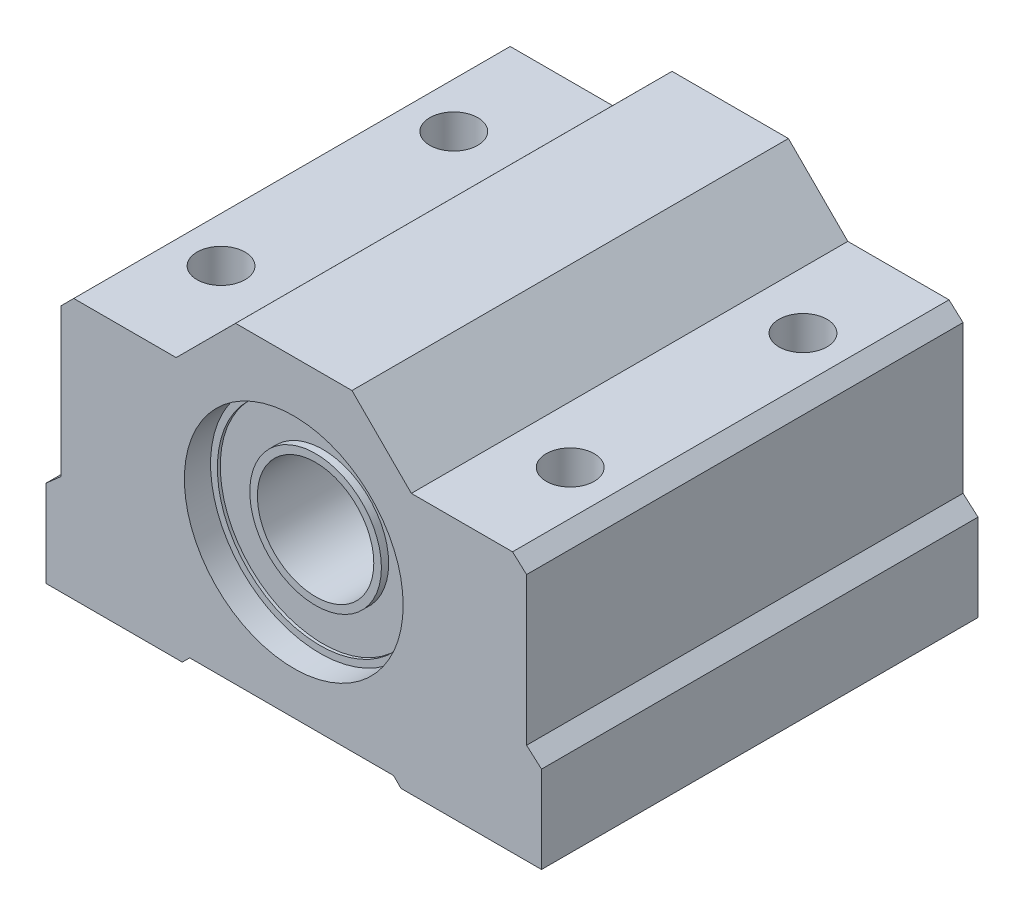
ISO-10303-21;
HEADER;
FILE_DESCRIPTION(('STEP AP214'),'2;1');
FILE_NAME('part.step','',(''),(''),'','','');
FILE_SCHEMA(('AUTOMOTIVE_DESIGN { 1 0 10303 214 1 1 1 1 }'));
ENDSEC;
DATA;
#1=APPLICATION_CONTEXT('core data for automotive mechanical design processes');
#2=APPLICATION_PROTOCOL_DEFINITION('international standard','automotive_design',2000,#1);
#3=PRODUCT_CONTEXT('',#1,'mechanical');
#4=PRODUCT('Part','Part','',(#3));
#5=PRODUCT_RELATED_PRODUCT_CATEGORY('part','',(#4));
#6=PRODUCT_DEFINITION_FORMATION('','',#4);
#7=PRODUCT_DEFINITION_CONTEXT('part definition',#1,'design');
#8=PRODUCT_DEFINITION('design','',#6,#7);
#9=PRODUCT_DEFINITION_SHAPE('','',#8);
#10=(LENGTH_UNIT() NAMED_UNIT(*) SI_UNIT(.MILLI.,.METRE.));
#11=(NAMED_UNIT(*) PLANE_ANGLE_UNIT() SI_UNIT($,.RADIAN.));
#12=(NAMED_UNIT(*) SI_UNIT($,.STERADIAN.) SOLID_ANGLE_UNIT());
#13=UNCERTAINTY_MEASURE_WITH_UNIT(LENGTH_MEASURE(1.E-05),#10,'distance_accuracy_value','');
#14=(GEOMETRIC_REPRESENTATION_CONTEXT(3) GLOBAL_UNCERTAINTY_ASSIGNED_CONTEXT((#13)) GLOBAL_UNIT_ASSIGNED_CONTEXT((#10,
#11,#12)) REPRESENTATION_CONTEXT('',''));
#15=CARTESIAN_POINT('',(0.,0.,0.));
#16=DIRECTION('',(0.,0.,1.));
#17=DIRECTION('',(1.,0.,0.));
#18=AXIS2_PLACEMENT_3D('',#15,#16,#17);
#19=CARTESIAN_POINT('',(0.,0.,-30.));
#20=DIRECTION('',(0.,0.,1.));
#21=DIRECTION('',(1.,0.,0.));
#22=AXIS2_PLACEMENT_3D('',#19,#20,#21);
#23=PLANE('',#22);
#24=DIRECTION('',(-0.748408560935745,-0.663237985882961,0.));
#25=VECTOR('',#24,1.);
#26=CARTESIAN_POINT('',(-5.00715940899254,5.65016034579369,-30.));
#27=LINE('',#26,#25);
#28=CARTESIAN_POINT('',(-15.9972160814821,-4.08920319527542,-30.));
#29=VERTEX_POINT('',#28);
#30=CARTESIAN_POINT('',(-17.03,-5.00445398438139,-30.));
#31=VERTEX_POINT('',#30);
#32=EDGE_CURVE('E254',#29,#31,#27,.T.);
#33=ORIENTED_EDGE('',*,*,#32,.F.);
#34=DIRECTION('',(0.,-1.,0.));
#35=VECTOR('',#34,1.);
#36=CARTESIAN_POINT('',(-15.9972160814821,0.,-30.));
#37=LINE('',#36,#35);
#38=CARTESIAN_POINT('',(-15.9972160814821,6.07141612040069,-30.));
#39=VERTEX_POINT('',#38);
#40=EDGE_CURVE('E192',#39,#29,#37,.T.);
#41=ORIENTED_EDGE('',*,*,#40,.F.);
#42=DIRECTION('',(-0.707106781186547,-0.707106781186548,0.));
#43=VECTOR('',#42,1.);
#44=CARTESIAN_POINT('',(-11.0343161009414,11.0343161009414,-30.));
#45=LINE('',#44,#43);
#46=CARTESIAN_POINT('',(-15.1243670871386,6.94426511474419,-30.));
#47=VERTEX_POINT('',#46);
#48=EDGE_CURVE('E177',#47,#39,#45,.T.);
#49=ORIENTED_EDGE('',*,*,#48,.F.);
#50=DIRECTION('',(-1.,0.,0.));
#51=VECTOR('',#50,1.);
#52=CARTESIAN_POINT('',(0.,6.9442651147442,-30.));
#53=LINE('',#52,#51);
#54=CARTESIAN_POINT('',(-8.083891516657,6.94426511474419,-30.));
#55=VERTEX_POINT('',#54);
#56=EDGE_CURVE('E190',#55,#47,#53,.T.);
#57=ORIENTED_EDGE('',*,*,#56,.F.);
#58=DIRECTION('',(-0.707276659522601,-0.706936862028393,0.));
#59=VECTOR('',#58,1.);
#60=CARTESIAN_POINT('',(-7.51213557308124,7.51574636915227,-30.));
#61=LINE('',#60,#59);
#62=CARTESIAN_POINT('',(-4.,11.0261946041163,-30.));
#63=VERTEX_POINT('',#62);
#64=EDGE_CURVE('E195',#63,#55,#61,.T.);
#65=ORIENTED_EDGE('',*,*,#64,.F.);
#66=DIRECTION('',(-1.,0.,0.));
#67=VECTOR('',#66,1.);
#68=CARTESIAN_POINT('',(0.,11.0261946041163,-30.));
#69=LINE('',#68,#67);
#70=CARTESIAN_POINT('',(4.,11.0261946041163,-30.));
#71=VERTEX_POINT('',#70);
#72=EDGE_CURVE('E197',#71,#63,#69,.T.);
#73=ORIENTED_EDGE('',*,*,#72,.F.);
#74=DIRECTION('',(-0.707106781186548,0.707106781186547,0.));
#75=VECTOR('',#74,1.);
#76=CARTESIAN_POINT('',(7.51309730205813,7.51309730205814,-30.));
#77=LINE('',#76,#75);
#78=CARTESIAN_POINT('',(8.0819294893721,6.94426511474417,-30.));
#79=VERTEX_POINT('',#78);
#80=EDGE_CURVE('E386',#79,#71,#77,.T.);
#81=ORIENTED_EDGE('',*,*,#80,.F.);
#82=DIRECTION('',(-1.,0.,0.));
#83=VECTOR('',#82,1.);
#84=CARTESIAN_POINT('',(0.,6.94426511474417,-30.));
#85=LINE('',#84,#83);
#86=CARTESIAN_POINT('',(15.0374546179448,6.94426511474418,-30.));
#87=VERTEX_POINT('',#86);
#88=EDGE_CURVE('E383',#87,#79,#85,.T.);
#89=ORIENTED_EDGE('',*,*,#88,.F.);
#90=DIRECTION('',(-0.741743771294362,0.670683366236272,0.));
#91=VECTOR('',#90,1.);
#92=CARTESIAN_POINT('',(10.2186901014741,11.301383208728,-30.));
#93=LINE('',#92,#91);
#94=CARTESIAN_POINT('',(16.0027839185179,6.07141612040066,-30.));
#95=VERTEX_POINT('',#94);
#96=EDGE_CURVE('E380',#95,#87,#93,.T.);
#97=ORIENTED_EDGE('',*,*,#96,.F.);
#98=DIRECTION('',(0.,1.,0.));
#99=VECTOR('',#98,1.);
#100=CARTESIAN_POINT('',(16.0027839185179,0.,-30.));
#101=LINE('',#100,#99);
#102=CARTESIAN_POINT('',(16.0027839185179,-4.08920319527547,-30.));
#103=VERTEX_POINT('',#102);
#104=EDGE_CURVE('E377',#103,#95,#101,.T.);
#105=ORIENTED_EDGE('',*,*,#104,.F.);
#106=DIRECTION('',(-0.749951735571776,0.661492550459097,0.));
#107=VECTOR('',#106,1.);
#108=CARTESIAN_POINT('',(4.97377394084638,5.63890008540626,-30.));
#109=LINE('',#108,#107);
#110=CARTESIAN_POINT('',(17.03,-4.99525588291164,-30.));
#111=VERTEX_POINT('',#110);
#112=EDGE_CURVE('E374',#111,#103,#109,.T.);
#113=ORIENTED_EDGE('',*,*,#112,.F.);
#114=DIRECTION('',(0.,1.,0.));
#115=VECTOR('',#114,1.);
#116=CARTESIAN_POINT('',(17.03,0.,-30.));
#117=LINE('',#116,#115);
#118=CARTESIAN_POINT('',(17.03,-10.9738053958837,-30.));
#119=VERTEX_POINT('',#118);
#120=EDGE_CURVE('E371',#119,#111,#117,.T.);
#121=ORIENTED_EDGE('',*,*,#120,.F.);
#122=DIRECTION('',(1.,0.,0.));
#123=VECTOR('',#122,1.);
#124=CARTESIAN_POINT('',(0.,-10.9738053958837,-30.));
#125=LINE('',#124,#123);
#126=CARTESIAN_POINT('',(7.36706184571891,-10.9738053958837,-30.));
#127=VERTEX_POINT('',#126);
#128=EDGE_CURVE('E368',#127,#119,#125,.T.);
#129=ORIENTED_EDGE('',*,*,#128,.F.);
#130=DIRECTION('',(0.707106781186548,-0.707106781186547,0.));
#131=VECTOR('',#130,1.);
#132=CARTESIAN_POINT('',(-1.80337177508242,-1.80337177508242,-30.));
#133=LINE('',#132,#131);
#134=CARTESIAN_POINT('',(6.85761623335725,-10.4643597835221,-30.));
#135=VERTEX_POINT('',#134);
#136=EDGE_CURVE('E365',#135,#127,#133,.T.);
#137=ORIENTED_EDGE('',*,*,#136,.F.);
#138=DIRECTION('',(1.,0.,0.));
#139=VECTOR('',#138,1.);
#140=CARTESIAN_POINT('',(0.,-10.4643597835221,-30.));
#141=LINE('',#140,#139);
#142=CARTESIAN_POINT('',(-7.15322917727557,-10.4643597835221,-30.));
#143=VERTEX_POINT('',#142);
#144=EDGE_CURVE('E362',#143,#135,#141,.T.);
#145=ORIENTED_EDGE('',*,*,#144,.F.);
#146=DIRECTION('',(0.707106781186549,0.707106781186546,0.));
#147=VECTOR('',#146,1.);
#148=CARTESIAN_POINT('',(1.65556530312327,-1.65556530312328,-30.));
#149=LINE('',#148,#147);
#150=CARTESIAN_POINT('',(-7.66267478963722,-10.9738053958837,-30.));
#151=VERTEX_POINT('',#150);
#152=EDGE_CURVE('E359',#151,#143,#149,.T.);
#153=ORIENTED_EDGE('',*,*,#152,.F.);
#154=DIRECTION('',(1.,0.,0.));
#155=VECTOR('',#154,1.);
#156=CARTESIAN_POINT('',(0.,-10.9738053958837,-30.));
#157=LINE('',#156,#155);
#158=CARTESIAN_POINT('',(-17.03,-10.9738053958837,-30.));
#159=VERTEX_POINT('',#158);
#160=EDGE_CURVE('E356',#159,#151,#157,.T.);
#161=ORIENTED_EDGE('',*,*,#160,.F.);
#162=DIRECTION('',(0.,-1.,0.));
#163=VECTOR('',#162,1.);
#164=CARTESIAN_POINT('',(-17.03,0.,-30.));
#165=LINE('',#164,#163);
#166=EDGE_CURVE('E354',#31,#159,#165,.T.);
#167=ORIENTED_EDGE('',*,*,#166,.F.);
#168=EDGE_LOOP('',(#33,#41,#49,#57,#65,#73,#81,#89,#97,#105,#113,#121,#129,#137,#145,#153,#161,#167));
#169=FACE_BOUND('',#168,.T.);
#170=CARTESIAN_POINT('',(0.,0.,-30.));
#171=DIRECTION('',(0.,0.,1.));
#172=DIRECTION('',(1.,0.,0.));
#173=AXIS2_PLACEMENT_3D('',#170,#171,#172);
#174=CIRCLE('',#173,7.51901731530374);
#175=CARTESIAN_POINT('',(7.51901731530374,0.,-30.));
#176=VERTEX_POINT('',#175);
#177=EDGE_CURVE('E329',#176,#176,#174,.T.);
#178=ORIENTED_EDGE('',*,*,#177,.T.);
#179=EDGE_LOOP('',(#178));
#180=FACE_BOUND('',#179,.T.);
#181=ADVANCED_FACE('F43',(#169,#180),#23,.F.);
#182=CARTESIAN_POINT('',(0.,0.,-2.));
#183=DIRECTION('',(0.,0.,1.));
#184=DIRECTION('',(1.,0.,0.));
#185=AXIS2_PLACEMENT_3D('',#182,#183,#184);
#186=CYLINDRICAL_SURFACE('',#185,7.0517883155918);
#187=CARTESIAN_POINT('',(0.,0.,-2.));
#188=DIRECTION('',(0.,0.,1.));
#189=DIRECTION('',(1.,0.,0.));
#190=AXIS2_PLACEMENT_3D('',#187,#188,#189);
#191=CIRCLE('',#190,7.0517883155918);
#192=CARTESIAN_POINT('',(7.0517883155918,0.,-2.));
#193=VERTEX_POINT('',#192);
#194=EDGE_CURVE('E336',#193,#193,#191,.T.);
#195=ORIENTED_EDGE('',*,*,#194,.F.);
#196=EDGE_LOOP('',(#195));
#197=FACE_BOUND('',#196,.T.);
#198=CARTESIAN_POINT('',(0.,0.,-1.8));
#199=DIRECTION('',(0.,0.,1.));
#200=DIRECTION('',(1.,0.,0.));
#201=AXIS2_PLACEMENT_3D('',#198,#199,#200);
#202=CIRCLE('',#201,7.0517883155918);
#203=CARTESIAN_POINT('',(7.0517883155918,0.,-1.8));
#204=VERTEX_POINT('',#203);
#205=EDGE_CURVE('E322',#204,#204,#202,.T.);
#206=ORIENTED_EDGE('',*,*,#205,.T.);
#207=EDGE_LOOP('',(#206));
#208=FACE_BOUND('',#207,.T.);
#209=ADVANCED_FACE('F298',(#197,#208),#186,.F.);
#210=CARTESIAN_POINT('',(0.,0.,-28.5));
#211=DIRECTION('',(0.,0.,1.));
#212=DIRECTION('',(1.,0.,0.));
#213=AXIS2_PLACEMENT_3D('',#210,#211,#212);
#214=CYLINDRICAL_SURFACE('',#213,4.);
#215=CARTESIAN_POINT('',(0.,0.,-28.5));
#216=DIRECTION('',(0.,0.,1.));
#217=DIRECTION('',(1.,0.,0.));
#218=AXIS2_PLACEMENT_3D('',#215,#216,#217);
#219=CIRCLE('',#218,4.);
#220=CARTESIAN_POINT('',(4.,0.,-28.5));
#221=VERTEX_POINT('',#220);
#222=EDGE_CURVE('E345',#221,#221,#219,.T.);
#223=ORIENTED_EDGE('',*,*,#222,.F.);
#224=EDGE_LOOP('',(#223));
#225=FACE_BOUND('',#224,.T.);
#226=CARTESIAN_POINT('',(0.,0.,-1.5));
#227=DIRECTION('',(0.,0.,1.));
#228=DIRECTION('',(1.,0.,0.));
#229=AXIS2_PLACEMENT_3D('',#226,#227,#228);
#230=CIRCLE('',#229,4.);
#231=CARTESIAN_POINT('',(4.,0.,-1.5));
#232=VERTEX_POINT('',#231);
#233=EDGE_CURVE('E342',#232,#232,#230,.T.);
#234=ORIENTED_EDGE('',*,*,#233,.T.);
#235=EDGE_LOOP('',(#234));
#236=FACE_BOUND('',#235,.T.);
#237=ADVANCED_FACE('F303',(#225,#236),#214,.F.);
#238=CARTESIAN_POINT('',(0.,0.,-30.));
#239=DIRECTION('',(0.,0.,1.));
#240=DIRECTION('',(1.,0.,0.));
#241=AXIS2_PLACEMENT_3D('',#238,#239,#240);
#242=CYLINDRICAL_SURFACE('',#241,7.0517883155918);
#243=CARTESIAN_POINT('',(0.,0.,-28.2));
#244=DIRECTION('',(0.,0.,1.));
#245=DIRECTION('',(1.,0.,0.));
#246=AXIS2_PLACEMENT_3D('',#243,#244,#245);
#247=CIRCLE('',#246,7.0517883155918);
#248=CARTESIAN_POINT('',(7.0517883155918,0.,-28.2));
#249=VERTEX_POINT('',#248);
#250=EDGE_CURVE('E486',#249,#249,#247,.T.);
#251=ORIENTED_EDGE('',*,*,#250,.F.);
#252=EDGE_LOOP('',(#251));
#253=FACE_BOUND('',#252,.T.);
#254=CARTESIAN_POINT('',(0.,0.,-28.));
#255=DIRECTION('',(0.,0.,1.));
#256=DIRECTION('',(1.,0.,0.));
#257=AXIS2_PLACEMENT_3D('',#254,#255,#256);
#258=CIRCLE('',#257,7.0517883155918);
#259=CARTESIAN_POINT('',(7.0517883155918,0.,-28.));
#260=VERTEX_POINT('',#259);
#261=EDGE_CURVE('E12',#260,#260,#258,.F.);
#262=ORIENTED_EDGE('',*,*,#261,.F.);
#263=EDGE_LOOP('',(#262));
#264=FACE_BOUND('',#263,.T.);
#265=ADVANCED_FACE('F295',(#253,#264),#242,.F.);
#266=CARTESIAN_POINT('',(-5.00715940899254,5.65016034579369,-30.));
#267=DIRECTION('',(-0.663237985882961,0.748408560935745,0.));
#268=DIRECTION('',(-0.748408560935745,-0.663237985882961,0.));
#269=AXIS2_PLACEMENT_3D('',#266,#267,#268);
#270=PLANE('',#269);
#271=DIRECTION('',(-0.748408560935745,-0.663237985882961,0.));
#272=VECTOR('',#271,1.);
#273=CARTESIAN_POINT('',(-5.00715940899254,5.65016034579369,0.));
#274=LINE('',#273,#272);
#275=CARTESIAN_POINT('',(-15.9972160814821,-4.08920319527542,0.));
#276=VERTEX_POINT('',#275);
#277=CARTESIAN_POINT('',(-17.03,-5.00445398438139,0.));
#278=VERTEX_POINT('',#277);
#279=EDGE_CURVE('E202',#276,#278,#274,.T.);
#280=ORIENTED_EDGE('',*,*,#279,.F.);
#281=DIRECTION('',(0.,0.,1.));
#282=VECTOR('',#281,1.);
#283=CARTESIAN_POINT('',(-15.9972160814821,-4.08920319527542,-30.));
#284=LINE('',#283,#282);
#285=EDGE_CURVE('E52',#29,#276,#284,.T.);
#286=ORIENTED_EDGE('',*,*,#285,.F.);
#287=ORIENTED_EDGE('',*,*,#32,.T.);
#288=DIRECTION('',(0.,0.,1.));
#289=VECTOR('',#288,1.);
#290=CARTESIAN_POINT('',(-17.03,-5.00445398438139,-30.));
#291=LINE('',#290,#289);
#292=EDGE_CURVE('E130',#31,#278,#291,.T.);
#293=ORIENTED_EDGE('',*,*,#292,.T.);
#294=EDGE_LOOP('',(#280,#286,#287,#293));
#295=FACE_BOUND('',#294,.T.);
#296=ADVANCED_FACE('F45',(#295),#270,.T.);
#297=CARTESIAN_POINT('',(-15.9972160814821,0.,-30.));
#298=DIRECTION('',(-1.,0.,0.));
#299=DIRECTION('',(0.,0.,1.));
#300=AXIS2_PLACEMENT_3D('',#297,#298,#299);
#301=PLANE('',#300);
#302=DIRECTION('',(0.,-1.,0.));
#303=VECTOR('',#302,1.);
#304=CARTESIAN_POINT('',(-15.9972160814821,0.,0.));
#305=LINE('',#304,#303);
#306=CARTESIAN_POINT('',(-15.9972160814821,6.07141612040069,0.));
#307=VERTEX_POINT('',#306);
#308=EDGE_CURVE('E251',#307,#276,#305,.T.);
#309=ORIENTED_EDGE('',*,*,#308,.F.);
#310=DIRECTION('',(0.,0.,1.));
#311=VECTOR('',#310,1.);
#312=CARTESIAN_POINT('',(-15.9972160814821,6.07141612040069,-30.));
#313=LINE('',#312,#311);
#314=EDGE_CURVE('E118',#39,#307,#313,.T.);
#315=ORIENTED_EDGE('',*,*,#314,.F.);
#316=ORIENTED_EDGE('',*,*,#40,.T.);
#317=ORIENTED_EDGE('',*,*,#285,.T.);
#318=EDGE_LOOP('',(#309,#315,#316,#317));
#319=FACE_BOUND('',#318,.T.);
#320=ADVANCED_FACE('F287',(#319),#301,.T.);
#321=CARTESIAN_POINT('',(-11.0343161009414,11.0343161009414,-30.));
#322=DIRECTION('',(-0.707106781186548,0.707106781186547,0.));
#323=DIRECTION('',(-0.707106781186547,-0.707106781186548,0.));
#324=AXIS2_PLACEMENT_3D('',#321,#322,#323);
#325=PLANE('',#324);
#326=DIRECTION('',(-0.707106781186547,-0.707106781186548,0.));
#327=VECTOR('',#326,1.);
#328=CARTESIAN_POINT('',(-11.0343161009414,11.0343161009414,0.));
#329=LINE('',#328,#327);
#330=CARTESIAN_POINT('',(-15.1243670871386,6.94426511474419,0.));
#331=VERTEX_POINT('',#330);
#332=EDGE_CURVE('E179',#331,#307,#329,.T.);
#333=ORIENTED_EDGE('',*,*,#332,.F.);
#334=DIRECTION('',(0.,0.,1.));
#335=VECTOR('',#334,1.);
#336=CARTESIAN_POINT('',(-15.1243670871386,6.94426511474419,-30.));
#337=LINE('',#336,#335);
#338=EDGE_CURVE('E174',#47,#331,#337,.T.);
#339=ORIENTED_EDGE('',*,*,#338,.F.);
#340=ORIENTED_EDGE('',*,*,#48,.T.);
#341=ORIENTED_EDGE('',*,*,#314,.T.);
#342=EDGE_LOOP('',(#333,#339,#340,#341));
#343=FACE_BOUND('',#342,.T.);
#344=ADVANCED_FACE('F176',(#343),#325,.T.);
#345=CARTESIAN_POINT('',(0.,6.9442651147442,-30.));
#346=DIRECTION('',(0.,1.,0.));
#347=DIRECTION('',(-1.,0.,0.));
#348=AXIS2_PLACEMENT_3D('',#345,#346,#347);
#349=PLANE('',#348);
#350=CARTESIAN_POINT('',(-12.,6.9442651147442,-23.));
#351=DIRECTION('',(0.,1.,0.));
#352=DIRECTION('',(-1.,0.,0.));
#353=AXIS2_PLACEMENT_3D('',#350,#351,#352);
#354=CIRCLE('',#353,1.65);
#355=CARTESIAN_POINT('',(-13.65,6.9442651147442,-23.));
#356=VERTEX_POINT('',#355);
#357=EDGE_CURVE('E483',#356,#356,#354,.T.);
#358=ORIENTED_EDGE('',*,*,#357,.F.);
#359=EDGE_LOOP('',(#358));
#360=FACE_BOUND('',#359,.T.);
#361=CARTESIAN_POINT('',(-12.,6.9442651147442,-7.));
#362=DIRECTION('',(0.,1.,0.));
#363=DIRECTION('',(-1.,0.,0.));
#364=AXIS2_PLACEMENT_3D('',#361,#362,#363);
#365=CIRCLE('',#364,1.65);
#366=CARTESIAN_POINT('',(-13.65,6.9442651147442,-7.));
#367=VERTEX_POINT('',#366);
#368=EDGE_CURVE('E482',#367,#367,#365,.T.);
#369=ORIENTED_EDGE('',*,*,#368,.F.);
#370=EDGE_LOOP('',(#369));
#371=FACE_BOUND('',#370,.T.);
#372=DIRECTION('',(-1.,0.,0.));
#373=VECTOR('',#372,1.);
#374=CARTESIAN_POINT('',(0.,6.9442651147442,0.));
#375=LINE('',#374,#373);
#376=CARTESIAN_POINT('',(-8.083891516657,6.94426511474419,0.));
#377=VERTEX_POINT('',#376);
#378=EDGE_CURVE('E248',#377,#331,#375,.T.);
#379=ORIENTED_EDGE('',*,*,#378,.F.);
#380=DIRECTION('',(0.,0.,1.));
#381=VECTOR('',#380,1.);
#382=CARTESIAN_POINT('',(-8.083891516657,6.94426511474419,-30.));
#383=LINE('',#382,#381);
#384=EDGE_CURVE('E184',#55,#377,#383,.T.);
#385=ORIENTED_EDGE('',*,*,#384,.F.);
#386=ORIENTED_EDGE('',*,*,#56,.T.);
#387=ORIENTED_EDGE('',*,*,#338,.T.);
#388=EDGE_LOOP('',(#379,#385,#386,#387));
#389=FACE_BOUND('',#388,.T.);
#390=ADVANCED_FACE('F194',(#360,#371,#389),#349,.T.);
#391=CARTESIAN_POINT('',(-7.51213557308124,7.51574636915227,-30.));
#392=DIRECTION('',(-0.706936862028393,0.707276659522601,0.));
#393=DIRECTION('',(-0.707276659522601,-0.706936862028393,0.));
#394=AXIS2_PLACEMENT_3D('',#391,#392,#393);
#395=PLANE('',#394);
#396=DIRECTION('',(-0.707276659522601,-0.706936862028393,0.));
#397=VECTOR('',#396,1.);
#398=CARTESIAN_POINT('',(-7.51213557308124,7.51574636915227,0.));
#399=LINE('',#398,#397);
#400=CARTESIAN_POINT('',(-4.,11.0261946041163,0.));
#401=VERTEX_POINT('',#400);
#402=EDGE_CURVE('E245',#401,#377,#399,.T.);
#403=ORIENTED_EDGE('',*,*,#402,.F.);
#404=DIRECTION('',(0.,0.,1.));
#405=VECTOR('',#404,1.);
#406=CARTESIAN_POINT('',(-4.,11.0261946041163,-30.));
#407=LINE('',#406,#405);
#408=EDGE_CURVE('E258',#63,#401,#407,.T.);
#409=ORIENTED_EDGE('',*,*,#408,.F.);
#410=ORIENTED_EDGE('',*,*,#64,.T.);
#411=ORIENTED_EDGE('',*,*,#384,.T.);
#412=EDGE_LOOP('',(#403,#409,#410,#411));
#413=FACE_BOUND('',#412,.T.);
#414=ADVANCED_FACE('F437',(#413),#395,.T.);
#415=CARTESIAN_POINT('',(0.,11.0261946041163,-30.));
#416=DIRECTION('',(0.,1.,0.));
#417=DIRECTION('',(-1.,0.,0.));
#418=AXIS2_PLACEMENT_3D('',#415,#416,#417);
#419=PLANE('',#418);
#420=DIRECTION('',(-1.,0.,0.));
#421=VECTOR('',#420,1.);
#422=CARTESIAN_POINT('',(0.,11.0261946041163,0.));
#423=LINE('',#422,#421);
#424=CARTESIAN_POINT('',(4.,11.0261946041163,0.));
#425=VERTEX_POINT('',#424);
#426=EDGE_CURVE('E242',#425,#401,#423,.T.);
#427=ORIENTED_EDGE('',*,*,#426,.F.);
#428=DIRECTION('',(0.,0.,1.));
#429=VECTOR('',#428,1.);
#430=CARTESIAN_POINT('',(4.,11.0261946041163,-30.));
#431=LINE('',#430,#429);
#432=EDGE_CURVE('E260',#71,#425,#431,.T.);
#433=ORIENTED_EDGE('',*,*,#432,.F.);
#434=ORIENTED_EDGE('',*,*,#72,.T.);
#435=ORIENTED_EDGE('',*,*,#408,.T.);
#436=EDGE_LOOP('',(#427,#433,#434,#435));
#437=FACE_BOUND('',#436,.T.);
#438=ADVANCED_FACE('F392',(#437),#419,.T.);
#439=CARTESIAN_POINT('',(7.51309730205813,7.51309730205814,-30.));
#440=DIRECTION('',(0.707106781186547,0.707106781186548,0.));
#441=DIRECTION('',(-0.707106781186548,0.707106781186547,0.));
#442=AXIS2_PLACEMENT_3D('',#439,#440,#441);
#443=PLANE('',#442);
#444=DIRECTION('',(-0.707106781186548,0.707106781186547,0.));
#445=VECTOR('',#444,1.);
#446=CARTESIAN_POINT('',(7.51309730205813,7.51309730205814,0.));
#447=LINE('',#446,#445);
#448=CARTESIAN_POINT('',(8.0819294893721,6.94426511474417,0.));
#449=VERTEX_POINT('',#448);
#450=EDGE_CURVE('E239',#449,#425,#447,.T.);
#451=ORIENTED_EDGE('',*,*,#450,.F.);
#452=DIRECTION('',(0.,0.,1.));
#453=VECTOR('',#452,1.);
#454=CARTESIAN_POINT('',(8.0819294893721,6.94426511474417,-30.));
#455=LINE('',#454,#453);
#456=EDGE_CURVE('E262',#79,#449,#455,.T.);
#457=ORIENTED_EDGE('',*,*,#456,.F.);
#458=ORIENTED_EDGE('',*,*,#80,.T.);
#459=ORIENTED_EDGE('',*,*,#432,.T.);
#460=EDGE_LOOP('',(#451,#457,#458,#459));
#461=FACE_BOUND('',#460,.T.);
#462=ADVANCED_FACE('F398',(#461),#443,.T.);
#463=CARTESIAN_POINT('',(0.,6.94426511474417,-30.));
#464=DIRECTION('',(0.,1.,0.));
#465=DIRECTION('',(-1.,0.,0.));
#466=AXIS2_PLACEMENT_3D('',#463,#464,#465);
#467=PLANE('',#466);
#468=CARTESIAN_POINT('',(12.,6.94426511474417,-7.));
#469=DIRECTION('',(0.,1.,0.));
#470=DIRECTION('',(-1.,0.,0.));
#471=AXIS2_PLACEMENT_3D('',#468,#469,#470);
#472=CIRCLE('',#471,1.65);
#473=CARTESIAN_POINT('',(10.35,6.94426511474417,-7.));
#474=VERTEX_POINT('',#473);
#475=EDGE_CURVE('E794',#474,#474,#472,.T.);
#476=ORIENTED_EDGE('',*,*,#475,.F.);
#477=EDGE_LOOP('',(#476));
#478=FACE_BOUND('',#477,.T.);
#479=CARTESIAN_POINT('',(12.,6.94426511474417,-23.));
#480=DIRECTION('',(0.,1.,0.));
#481=DIRECTION('',(-1.,0.,0.));
#482=AXIS2_PLACEMENT_3D('',#479,#480,#481);
#483=CIRCLE('',#482,1.65);
#484=CARTESIAN_POINT('',(10.35,6.94426511474417,-23.));
#485=VERTEX_POINT('',#484);
#486=EDGE_CURVE('E804',#485,#485,#483,.T.);
#487=ORIENTED_EDGE('',*,*,#486,.F.);
#488=EDGE_LOOP('',(#487));
#489=FACE_BOUND('',#488,.T.);
#490=DIRECTION('',(-1.,0.,0.));
#491=VECTOR('',#490,1.);
#492=CARTESIAN_POINT('',(0.,6.94426511474417,0.));
#493=LINE('',#492,#491);
#494=CARTESIAN_POINT('',(15.0374546179448,6.94426511474418,0.));
#495=VERTEX_POINT('',#494);
#496=EDGE_CURVE('E236',#495,#449,#493,.T.);
#497=ORIENTED_EDGE('',*,*,#496,.F.);
#498=DIRECTION('',(0.,0.,1.));
#499=VECTOR('',#498,1.);
#500=CARTESIAN_POINT('',(15.0374546179448,6.94426511474418,-30.));
#501=LINE('',#500,#499);
#502=EDGE_CURVE('E264',#87,#495,#501,.T.);
#503=ORIENTED_EDGE('',*,*,#502,.F.);
#504=ORIENTED_EDGE('',*,*,#88,.T.);
#505=ORIENTED_EDGE('',*,*,#456,.T.);
#506=EDGE_LOOP('',(#497,#503,#504,#505));
#507=FACE_BOUND('',#506,.T.);
#508=ADVANCED_FACE('F401',(#478,#489,#507),#467,.T.);
#509=CARTESIAN_POINT('',(10.2186901014741,11.301383208728,-30.));
#510=DIRECTION('',(0.670683366236272,0.741743771294362,0.));
#511=DIRECTION('',(-0.741743771294362,0.670683366236272,0.));
#512=AXIS2_PLACEMENT_3D('',#509,#510,#511);
#513=PLANE('',#512);
#514=DIRECTION('',(-0.741743771294362,0.670683366236272,0.));
#515=VECTOR('',#514,1.);
#516=CARTESIAN_POINT('',(10.2186901014741,11.301383208728,0.));
#517=LINE('',#516,#515);
#518=CARTESIAN_POINT('',(16.0027839185179,6.07141612040066,0.));
#519=VERTEX_POINT('',#518);
#520=EDGE_CURVE('E233',#519,#495,#517,.T.);
#521=ORIENTED_EDGE('',*,*,#520,.F.);
#522=DIRECTION('',(0.,0.,1.));
#523=VECTOR('',#522,1.);
#524=CARTESIAN_POINT('',(16.0027839185179,6.07141612040066,-30.));
#525=LINE('',#524,#523);
#526=EDGE_CURVE('E266',#95,#519,#525,.T.);
#527=ORIENTED_EDGE('',*,*,#526,.F.);
#528=ORIENTED_EDGE('',*,*,#96,.T.);
#529=ORIENTED_EDGE('',*,*,#502,.T.);
#530=EDGE_LOOP('',(#521,#527,#528,#529));
#531=FACE_BOUND('',#530,.T.);
#532=ADVANCED_FACE('F406',(#531),#513,.T.);
#533=CARTESIAN_POINT('',(16.0027839185179,0.,-30.));
#534=DIRECTION('',(1.,0.,0.));
#535=DIRECTION('',(0.,0.,-1.));
#536=AXIS2_PLACEMENT_3D('',#533,#534,#535);
#537=PLANE('',#536);
#538=DIRECTION('',(0.,1.,0.));
#539=VECTOR('',#538,1.);
#540=CARTESIAN_POINT('',(16.0027839185179,0.,0.));
#541=LINE('',#540,#539);
#542=CARTESIAN_POINT('',(16.0027839185179,-4.08920319527547,0.));
#543=VERTEX_POINT('',#542);
#544=EDGE_CURVE('E230',#543,#519,#541,.T.);
#545=ORIENTED_EDGE('',*,*,#544,.F.);
#546=DIRECTION('',(0.,0.,1.));
#547=VECTOR('',#546,1.);
#548=CARTESIAN_POINT('',(16.0027839185179,-4.08920319527547,-30.));
#549=LINE('',#548,#547);
#550=EDGE_CURVE('E268',#103,#543,#549,.T.);
#551=ORIENTED_EDGE('',*,*,#550,.F.);
#552=ORIENTED_EDGE('',*,*,#104,.T.);
#553=ORIENTED_EDGE('',*,*,#526,.T.);
#554=EDGE_LOOP('',(#545,#551,#552,#553));
#555=FACE_BOUND('',#554,.T.);
#556=ADVANCED_FACE('F409',(#555),#537,.T.);
#557=CARTESIAN_POINT('',(4.97377394084638,5.63890008540626,-30.));
#558=DIRECTION('',(0.661492550459097,0.749951735571776,0.));
#559=DIRECTION('',(-0.749951735571776,0.661492550459097,0.));
#560=AXIS2_PLACEMENT_3D('',#557,#558,#559);
#561=PLANE('',#560);
#562=DIRECTION('',(-0.749951735571776,0.661492550459097,0.));
#563=VECTOR('',#562,1.);
#564=CARTESIAN_POINT('',(4.97377394084638,5.63890008540626,0.));
#565=LINE('',#564,#563);
#566=CARTESIAN_POINT('',(17.03,-4.99525588291164,0.));
#567=VERTEX_POINT('',#566);
#568=EDGE_CURVE('E227',#567,#543,#565,.T.);
#569=ORIENTED_EDGE('',*,*,#568,.F.);
#570=DIRECTION('',(0.,0.,1.));
#571=VECTOR('',#570,1.);
#572=CARTESIAN_POINT('',(17.03,-4.99525588291164,-30.));
#573=LINE('',#572,#571);
#574=EDGE_CURVE('E270',#111,#567,#573,.T.);
#575=ORIENTED_EDGE('',*,*,#574,.F.);
#576=ORIENTED_EDGE('',*,*,#112,.T.);
#577=ORIENTED_EDGE('',*,*,#550,.T.);
#578=EDGE_LOOP('',(#569,#575,#576,#577));
#579=FACE_BOUND('',#578,.T.);
#580=ADVANCED_FACE('F414',(#579),#561,.T.);
#581=CARTESIAN_POINT('',(17.03,0.,-30.));
#582=DIRECTION('',(1.,0.,0.));
#583=DIRECTION('',(0.,0.,-1.));
#584=AXIS2_PLACEMENT_3D('',#581,#582,#583);
#585=PLANE('',#584);
#586=DIRECTION('',(0.,1.,0.));
#587=VECTOR('',#586,1.);
#588=CARTESIAN_POINT('',(17.03,0.,0.));
#589=LINE('',#588,#587);
#590=CARTESIAN_POINT('',(17.03,-10.9738053958837,0.));
#591=VERTEX_POINT('',#590);
#592=EDGE_CURVE('E224',#591,#567,#589,.T.);
#593=ORIENTED_EDGE('',*,*,#592,.F.);
#594=DIRECTION('',(0.,0.,1.));
#595=VECTOR('',#594,1.);
#596=CARTESIAN_POINT('',(17.03,-10.9738053958837,-30.));
#597=LINE('',#596,#595);
#598=EDGE_CURVE('E272',#119,#591,#597,.T.);
#599=ORIENTED_EDGE('',*,*,#598,.F.);
#600=ORIENTED_EDGE('',*,*,#120,.T.);
#601=ORIENTED_EDGE('',*,*,#574,.T.);
#602=EDGE_LOOP('',(#593,#599,#600,#601));
#603=FACE_BOUND('',#602,.T.);
#604=ADVANCED_FACE('F417',(#603),#585,.T.);
#605=CARTESIAN_POINT('',(0.,-10.9738053958837,-30.));
#606=DIRECTION('',(0.,-1.,0.));
#607=DIRECTION('',(0.,0.,-1.));
#608=AXIS2_PLACEMENT_3D('',#605,#606,#607);
#609=PLANE('',#608);
#610=CARTESIAN_POINT('',(12.,-10.9738053958837,-7.));
#611=DIRECTION('',(0.,-1.,0.));
#612=DIRECTION('',(0.,0.,-1.));
#613=AXIS2_PLACEMENT_3D('',#610,#611,#612);
#614=CIRCLE('',#613,1.65);
#615=CARTESIAN_POINT('',(12.,-10.9738053958837,-8.65));
#616=VERTEX_POINT('',#615);
#617=EDGE_CURVE('E797',#616,#616,#614,.T.);
#618=ORIENTED_EDGE('',*,*,#617,.F.);
#619=EDGE_LOOP('',(#618));
#620=FACE_BOUND('',#619,.T.);
#621=CARTESIAN_POINT('',(12.,-10.9738053958837,-23.));
#622=DIRECTION('',(0.,-1.,0.));
#623=DIRECTION('',(0.,0.,-1.));
#624=AXIS2_PLACEMENT_3D('',#621,#622,#623);
#625=CIRCLE('',#624,1.65);
#626=CARTESIAN_POINT('',(12.,-10.9738053958837,-24.65));
#627=VERTEX_POINT('',#626);
#628=EDGE_CURVE('E799',#627,#627,#625,.T.);
#629=ORIENTED_EDGE('',*,*,#628,.F.);
#630=EDGE_LOOP('',(#629));
#631=FACE_BOUND('',#630,.T.);
#632=DIRECTION('',(1.,0.,0.));
#633=VECTOR('',#632,1.);
#634=CARTESIAN_POINT('',(0.,-10.9738053958837,0.));
#635=LINE('',#634,#633);
#636=CARTESIAN_POINT('',(7.36706184571891,-10.9738053958837,0.));
#637=VERTEX_POINT('',#636);
#638=EDGE_CURVE('E221',#637,#591,#635,.T.);
#639=ORIENTED_EDGE('',*,*,#638,.F.);
#640=DIRECTION('',(0.,0.,1.));
#641=VECTOR('',#640,1.);
#642=CARTESIAN_POINT('',(7.36706184571891,-10.9738053958837,-30.));
#643=LINE('',#642,#641);
#644=EDGE_CURVE('E274',#127,#637,#643,.T.);
#645=ORIENTED_EDGE('',*,*,#644,.F.);
#646=ORIENTED_EDGE('',*,*,#128,.T.);
#647=ORIENTED_EDGE('',*,*,#598,.T.);
#648=EDGE_LOOP('',(#639,#645,#646,#647));
#649=FACE_BOUND('',#648,.T.);
#650=ADVANCED_FACE('F422',(#620,#631,#649),#609,.T.);
#651=CARTESIAN_POINT('',(-1.80337177508242,-1.80337177508242,-30.));
#652=DIRECTION('',(-0.707106781186547,-0.707106781186548,0.));
#653=DIRECTION('',(0.707106781186548,-0.707106781186547,0.));
#654=AXIS2_PLACEMENT_3D('',#651,#652,#653);
#655=PLANE('',#654);
#656=DIRECTION('',(0.707106781186548,-0.707106781186547,0.));
#657=VECTOR('',#656,1.);
#658=CARTESIAN_POINT('',(-1.80337177508242,-1.80337177508242,0.));
#659=LINE('',#658,#657);
#660=CARTESIAN_POINT('',(6.85761623335725,-10.4643597835221,0.));
#661=VERTEX_POINT('',#660);
#662=EDGE_CURVE('E218',#661,#637,#659,.T.);
#663=ORIENTED_EDGE('',*,*,#662,.F.);
#664=DIRECTION('',(0.,0.,1.));
#665=VECTOR('',#664,1.);
#666=CARTESIAN_POINT('',(6.85761623335725,-10.4643597835221,-30.));
#667=LINE('',#666,#665);
#668=EDGE_CURVE('E276',#135,#661,#667,.T.);
#669=ORIENTED_EDGE('',*,*,#668,.F.);
#670=ORIENTED_EDGE('',*,*,#136,.T.);
#671=ORIENTED_EDGE('',*,*,#644,.T.);
#672=EDGE_LOOP('',(#663,#669,#670,#671));
#673=FACE_BOUND('',#672,.T.);
#674=ADVANCED_FACE('F425',(#673),#655,.T.);
#675=CARTESIAN_POINT('',(0.,-10.4643597835221,-30.));
#676=DIRECTION('',(0.,-1.,0.));
#677=DIRECTION('',(0.,0.,-1.));
#678=AXIS2_PLACEMENT_3D('',#675,#676,#677);
#679=PLANE('',#678);
#680=DIRECTION('',(1.,0.,0.));
#681=VECTOR('',#680,1.);
#682=CARTESIAN_POINT('',(0.,-10.4643597835221,0.));
#683=LINE('',#682,#681);
#684=CARTESIAN_POINT('',(-7.15322917727557,-10.4643597835221,0.));
#685=VERTEX_POINT('',#684);
#686=EDGE_CURVE('E215',#685,#661,#683,.T.);
#687=ORIENTED_EDGE('',*,*,#686,.F.);
#688=DIRECTION('',(0.,0.,1.));
#689=VECTOR('',#688,1.);
#690=CARTESIAN_POINT('',(-7.15322917727557,-10.4643597835221,-30.));
#691=LINE('',#690,#689);
#692=EDGE_CURVE('E278',#143,#685,#691,.T.);
#693=ORIENTED_EDGE('',*,*,#692,.F.);
#694=ORIENTED_EDGE('',*,*,#144,.T.);
#695=ORIENTED_EDGE('',*,*,#668,.T.);
#696=EDGE_LOOP('',(#687,#693,#694,#695));
#697=FACE_BOUND('',#696,.T.);
#698=ADVANCED_FACE('F430',(#697),#679,.T.);
#699=CARTESIAN_POINT('',(1.65556530312327,-1.65556530312328,-30.));
#700=DIRECTION('',(0.707106781186546,-0.707106781186549,0.));
#701=DIRECTION('',(0.707106781186549,0.707106781186546,0.));
#702=AXIS2_PLACEMENT_3D('',#699,#700,#701);
#703=PLANE('',#702);
#704=DIRECTION('',(0.707106781186549,0.707106781186546,0.));
#705=VECTOR('',#704,1.);
#706=CARTESIAN_POINT('',(1.65556530312327,-1.65556530312328,0.));
#707=LINE('',#706,#705);
#708=CARTESIAN_POINT('',(-7.66267478963722,-10.9738053958837,0.));
#709=VERTEX_POINT('',#708);
#710=EDGE_CURVE('E212',#709,#685,#707,.T.);
#711=ORIENTED_EDGE('',*,*,#710,.F.);
#712=DIRECTION('',(0.,0.,1.));
#713=VECTOR('',#712,1.);
#714=CARTESIAN_POINT('',(-7.66267478963722,-10.9738053958837,-30.));
#715=LINE('',#714,#713);
#716=EDGE_CURVE('E280',#151,#709,#715,.T.);
#717=ORIENTED_EDGE('',*,*,#716,.F.);
#718=ORIENTED_EDGE('',*,*,#152,.T.);
#719=ORIENTED_EDGE('',*,*,#692,.T.);
#720=EDGE_LOOP('',(#711,#717,#718,#719));
#721=FACE_BOUND('',#720,.T.);
#722=ADVANCED_FACE('F433',(#721),#703,.T.);
#723=CARTESIAN_POINT('',(0.,-10.9738053958837,-30.));
#724=DIRECTION('',(0.,-1.,0.));
#725=DIRECTION('',(1.,0.,0.));
#726=AXIS2_PLACEMENT_3D('',#723,#724,#725);
#727=PLANE('',#726);
#728=CARTESIAN_POINT('',(-12.,-10.9738053958837,-23.));
#729=DIRECTION('',(0.,-1.,0.));
#730=DIRECTION('',(0.,0.,-1.));
#731=AXIS2_PLACEMENT_3D('',#728,#729,#730);
#732=CIRCLE('',#731,1.65);
#733=CARTESIAN_POINT('',(-12.,-10.9738053958837,-24.65));
#734=VERTEX_POINT('',#733);
#735=EDGE_CURVE('E477',#734,#734,#732,.T.);
#736=ORIENTED_EDGE('',*,*,#735,.F.);
#737=EDGE_LOOP('',(#736));
#738=FACE_BOUND('',#737,.T.);
#739=CARTESIAN_POINT('',(-12.,-10.9738053958837,-7.));
#740=DIRECTION('',(0.,-1.,0.));
#741=DIRECTION('',(0.,0.,-1.));
#742=AXIS2_PLACEMENT_3D('',#739,#740,#741);
#743=CIRCLE('',#742,1.65);
#744=CARTESIAN_POINT('',(-12.,-10.9738053958837,-8.65));
#745=VERTEX_POINT('',#744);
#746=EDGE_CURVE('E480',#745,#745,#743,.T.);
#747=ORIENTED_EDGE('',*,*,#746,.F.);
#748=EDGE_LOOP('',(#747));
#749=FACE_BOUND('',#748,.T.);
#750=DIRECTION('',(1.,0.,0.));
#751=VECTOR('',#750,1.);
#752=CARTESIAN_POINT('',(0.,-10.9738053958837,0.));
#753=LINE('',#752,#751);
#754=CARTESIAN_POINT('',(-17.03,-10.9738053958837,0.));
#755=VERTEX_POINT('',#754);
#756=EDGE_CURVE('E209',#755,#709,#753,.T.);
#757=ORIENTED_EDGE('',*,*,#756,.F.);
#758=DIRECTION('',(0.,0.,1.));
#759=VECTOR('',#758,1.);
#760=CARTESIAN_POINT('',(-17.03,-10.9738053958837,-30.));
#761=LINE('',#760,#759);
#762=EDGE_CURVE('E282',#159,#755,#761,.T.);
#763=ORIENTED_EDGE('',*,*,#762,.F.);
#764=ORIENTED_EDGE('',*,*,#160,.T.);
#765=ORIENTED_EDGE('',*,*,#716,.T.);
#766=EDGE_LOOP('',(#757,#763,#764,#765));
#767=FACE_BOUND('',#766,.T.);
#768=ADVANCED_FACE('F317',(#738,#749,#767),#727,.T.);
#769=CARTESIAN_POINT('',(-17.03,0.,-30.));
#770=DIRECTION('',(-1.,0.,0.));
#771=DIRECTION('',(0.,0.,1.));
#772=AXIS2_PLACEMENT_3D('',#769,#770,#771);
#773=PLANE('',#772);
#774=DIRECTION('',(0.,-1.,0.));
#775=VECTOR('',#774,1.);
#776=CARTESIAN_POINT('',(-17.03,0.,0.));
#777=LINE('',#776,#775);
#778=EDGE_CURVE('E205',#278,#755,#777,.T.);
#779=ORIENTED_EDGE('',*,*,#778,.F.);
#780=ORIENTED_EDGE('',*,*,#292,.F.);
#781=ORIENTED_EDGE('',*,*,#166,.T.);
#782=ORIENTED_EDGE('',*,*,#762,.T.);
#783=EDGE_LOOP('',(#779,#780,#781,#782));
#784=FACE_BOUND('',#783,.T.);
#785=ADVANCED_FACE('F283',(#784),#773,.T.);
#786=CARTESIAN_POINT('',(0.,0.,0.));
#787=DIRECTION('',(0.,0.,1.));
#788=DIRECTION('',(1.,0.,0.));
#789=AXIS2_PLACEMENT_3D('',#786,#787,#788);
#790=PLANE('',#789);
#791=CARTESIAN_POINT('',(0.,0.,0.));
#792=DIRECTION('',(0.,0.,1.));
#793=DIRECTION('',(1.,0.,0.));
#794=AXIS2_PLACEMENT_3D('',#791,#792,#793);
#795=CIRCLE('',#794,7.51901731530374);
#796=CARTESIAN_POINT('',(7.51901731530374,0.,0.));
#797=VERTEX_POINT('',#796);
#798=EDGE_CURVE('E320',#797,#797,#795,.T.);
#799=ORIENTED_EDGE('',*,*,#798,.F.);
#800=EDGE_LOOP('',(#799));
#801=FACE_BOUND('',#800,.T.);
#802=ORIENTED_EDGE('',*,*,#279,.T.);
#803=ORIENTED_EDGE('',*,*,#778,.T.);
#804=ORIENTED_EDGE('',*,*,#756,.T.);
#805=ORIENTED_EDGE('',*,*,#710,.T.);
#806=ORIENTED_EDGE('',*,*,#686,.T.);
#807=ORIENTED_EDGE('',*,*,#662,.T.);
#808=ORIENTED_EDGE('',*,*,#638,.T.);
#809=ORIENTED_EDGE('',*,*,#592,.T.);
#810=ORIENTED_EDGE('',*,*,#568,.T.);
#811=ORIENTED_EDGE('',*,*,#544,.T.);
#812=ORIENTED_EDGE('',*,*,#520,.T.);
#813=ORIENTED_EDGE('',*,*,#496,.T.);
#814=ORIENTED_EDGE('',*,*,#450,.T.);
#815=ORIENTED_EDGE('',*,*,#426,.T.);
#816=ORIENTED_EDGE('',*,*,#402,.T.);
#817=ORIENTED_EDGE('',*,*,#378,.T.);
#818=ORIENTED_EDGE('',*,*,#332,.T.);
#819=ORIENTED_EDGE('',*,*,#308,.T.);
#820=EDGE_LOOP('',(#802,#803,#804,#805,#806,#807,#808,#809,#810,#811,#812,#813,#814,#815,#816,
#817,#818,#819));
#821=FACE_BOUND('',#820,.T.);
#822=ADVANCED_FACE('F286',(#801,#821),#790,.T.);
#823=CARTESIAN_POINT('',(0.,0.,-28.));
#824=DIRECTION('',(0.,0.,1.));
#825=DIRECTION('',(1.,0.,0.));
#826=AXIS2_PLACEMENT_3D('',#823,#824,#825);
#827=PLANE('',#826);
#828=CARTESIAN_POINT('',(0.,0.,-28.));
#829=DIRECTION('',(0.,0.,1.));
#830=DIRECTION('',(1.,0.,0.));
#831=AXIS2_PLACEMENT_3D('',#828,#829,#830);
#832=CIRCLE('',#831,4.52339298245236);
#833=CARTESIAN_POINT('',(4.52339298245236,0.,-28.));
#834=VERTEX_POINT('',#833);
#835=EDGE_CURVE('E206',#834,#834,#832,.T.);
#836=ORIENTED_EDGE('',*,*,#835,.T.);
#837=EDGE_LOOP('',(#836));
#838=FACE_BOUND('',#837,.T.);
#839=ORIENTED_EDGE('',*,*,#261,.T.);
#840=EDGE_LOOP('',(#839));
#841=FACE_BOUND('',#840,.T.);
#842=ADVANCED_FACE('F309',(#838,#841),#827,.F.);
#843=CARTESIAN_POINT('',(0.,0.,-28.5));
#844=DIRECTION('',(0.,0.,1.));
#845=DIRECTION('',(1.,0.,0.));
#846=AXIS2_PLACEMENT_3D('',#843,#844,#845);
#847=CYLINDRICAL_SURFACE('',#846,4.52339298245236);
#848=CARTESIAN_POINT('',(0.,0.,-28.5));
#849=DIRECTION('',(0.,0.,1.));
#850=DIRECTION('',(1.,0.,0.));
#851=AXIS2_PLACEMENT_3D('',#848,#849,#850);
#852=CIRCLE('',#851,4.52339298245236);
#853=CARTESIAN_POINT('',(4.52339298245236,0.,-28.5));
#854=VERTEX_POINT('',#853);
#855=EDGE_CURVE('E348',#854,#854,#852,.T.);
#856=ORIENTED_EDGE('',*,*,#855,.T.);
#857=EDGE_LOOP('',(#856));
#858=FACE_BOUND('',#857,.T.);
#859=ORIENTED_EDGE('',*,*,#835,.F.);
#860=EDGE_LOOP('',(#859));
#861=FACE_BOUND('',#860,.T.);
#862=ADVANCED_FACE('F315',(#858,#861),#847,.T.);
#863=CARTESIAN_POINT('',(0.,0.,-28.5));
#864=DIRECTION('',(0.,0.,1.));
#865=DIRECTION('',(1.,0.,0.));
#866=AXIS2_PLACEMENT_3D('',#863,#864,#865);
#867=PLANE('',#866);
#868=ORIENTED_EDGE('',*,*,#222,.T.);
#869=EDGE_LOOP('',(#868));
#870=FACE_BOUND('',#869,.T.);
#871=ORIENTED_EDGE('',*,*,#855,.F.);
#872=EDGE_LOOP('',(#871));
#873=FACE_BOUND('',#872,.T.);
#874=ADVANCED_FACE('F532',(#870,#873),#867,.F.);
#875=CARTESIAN_POINT('',(0.,0.,-1.5));
#876=DIRECTION('',(0.,0.,1.));
#877=DIRECTION('',(1.,0.,0.));
#878=AXIS2_PLACEMENT_3D('',#875,#876,#877);
#879=PLANE('',#878);
#880=ORIENTED_EDGE('',*,*,#233,.F.);
#881=EDGE_LOOP('',(#880));
#882=FACE_BOUND('',#881,.T.);
#883=CARTESIAN_POINT('',(0.,0.,-1.5));
#884=DIRECTION('',(0.,0.,1.));
#885=DIRECTION('',(1.,0.,0.));
#886=AXIS2_PLACEMENT_3D('',#883,#884,#885);
#887=CIRCLE('',#886,4.52339298245236);
#888=CARTESIAN_POINT('',(4.52339298245236,0.,-1.5));
#889=VERTEX_POINT('',#888);
#890=EDGE_CURVE('E339',#889,#889,#887,.T.);
#891=ORIENTED_EDGE('',*,*,#890,.T.);
#892=EDGE_LOOP('',(#891));
#893=FACE_BOUND('',#892,.T.);
#894=ADVANCED_FACE('F528',(#882,#893),#879,.T.);
#895=CARTESIAN_POINT('',(0.,0.,-2.));
#896=DIRECTION('',(0.,0.,1.));
#897=DIRECTION('',(1.,0.,0.));
#898=AXIS2_PLACEMENT_3D('',#895,#896,#897);
#899=CYLINDRICAL_SURFACE('',#898,4.52339298245236);
#900=ORIENTED_EDGE('',*,*,#890,.F.);
#901=EDGE_LOOP('',(#900));
#902=FACE_BOUND('',#901,.T.);
#903=CARTESIAN_POINT('',(0.,0.,-2.));
#904=DIRECTION('',(0.,0.,1.));
#905=DIRECTION('',(1.,0.,0.));
#906=AXIS2_PLACEMENT_3D('',#903,#904,#905);
#907=CIRCLE('',#906,4.52339298245236);
#908=CARTESIAN_POINT('',(4.52339298245236,0.,-2.));
#909=VERTEX_POINT('',#908);
#910=EDGE_CURVE('E333',#909,#909,#907,.T.);
#911=ORIENTED_EDGE('',*,*,#910,.T.);
#912=EDGE_LOOP('',(#911));
#913=FACE_BOUND('',#912,.T.);
#914=ADVANCED_FACE('F523',(#902,#913),#899,.T.);
#915=CARTESIAN_POINT('',(0.,0.,-2.));
#916=DIRECTION('',(0.,0.,1.));
#917=DIRECTION('',(1.,0.,0.));
#918=AXIS2_PLACEMENT_3D('',#915,#916,#917);
#919=PLANE('',#918);
#920=ORIENTED_EDGE('',*,*,#910,.F.);
#921=EDGE_LOOP('',(#920));
#922=FACE_BOUND('',#921,.T.);
#923=ORIENTED_EDGE('',*,*,#194,.T.);
#924=EDGE_LOOP('',(#923));
#925=FACE_BOUND('',#924,.T.);
#926=ADVANCED_FACE('F520',(#922,#925),#919,.T.);
#927=CARTESIAN_POINT('',(0.,0.,-1.8));
#928=DIRECTION('',(0.,0.,1.));
#929=DIRECTION('',(1.,0.,0.));
#930=AXIS2_PLACEMENT_3D('',#927,#928,#929);
#931=CYLINDRICAL_SURFACE('',#930,7.51901731530374);
#932=CARTESIAN_POINT('',(0.,0.,-1.8));
#933=DIRECTION('',(0.,0.,1.));
#934=DIRECTION('',(1.,0.,0.));
#935=AXIS2_PLACEMENT_3D('',#932,#933,#934);
#936=CIRCLE('',#935,7.51901731530374);
#937=CARTESIAN_POINT('',(7.51901731530374,0.,-1.8));
#938=VERTEX_POINT('',#937);
#939=EDGE_CURVE('E326',#938,#938,#936,.T.);
#940=ORIENTED_EDGE('',*,*,#939,.F.);
#941=EDGE_LOOP('',(#940));
#942=FACE_BOUND('',#941,.T.);
#943=ORIENTED_EDGE('',*,*,#798,.T.);
#944=EDGE_LOOP('',(#943));
#945=FACE_BOUND('',#944,.T.);
#946=ADVANCED_FACE('F516',(#942,#945),#931,.F.);
#947=CARTESIAN_POINT('',(0.,0.,-1.8));
#948=DIRECTION('',(0.,0.,1.));
#949=DIRECTION('',(1.,0.,0.));
#950=AXIS2_PLACEMENT_3D('',#947,#948,#949);
#951=PLANE('',#950);
#952=ORIENTED_EDGE('',*,*,#205,.F.);
#953=EDGE_LOOP('',(#952));
#954=FACE_BOUND('',#953,.T.);
#955=ORIENTED_EDGE('',*,*,#939,.T.);
#956=EDGE_LOOP('',(#955));
#957=FACE_BOUND('',#956,.T.);
#958=ADVANCED_FACE('F510',(#954,#957),#951,.T.);
#959=CARTESIAN_POINT('',(0.,0.,-28.2));
#960=DIRECTION('',(0.,0.,1.));
#961=DIRECTION('',(1.,0.,0.));
#962=AXIS2_PLACEMENT_3D('',#959,#960,#961);
#963=PLANE('',#962);
#964=CARTESIAN_POINT('',(0.,0.,-28.2));
#965=DIRECTION('',(0.,0.,1.));
#966=DIRECTION('',(1.,0.,0.));
#967=AXIS2_PLACEMENT_3D('',#964,#965,#966);
#968=CIRCLE('',#967,7.51901731530374);
#969=CARTESIAN_POINT('',(7.51901731530374,0.,-28.2));
#970=VERTEX_POINT('',#969);
#971=EDGE_CURVE('E323',#970,#970,#968,.T.);
#972=ORIENTED_EDGE('',*,*,#971,.F.);
#973=EDGE_LOOP('',(#972));
#974=FACE_BOUND('',#973,.T.);
#975=ORIENTED_EDGE('',*,*,#250,.T.);
#976=EDGE_LOOP('',(#975));
#977=FACE_BOUND('',#976,.T.);
#978=ADVANCED_FACE('F500',(#974,#977),#963,.F.);
#979=CARTESIAN_POINT('',(0.,0.,-28.2));
#980=DIRECTION('',(0.,0.,-1.));
#981=DIRECTION('',(-1.,0.,0.));
#982=AXIS2_PLACEMENT_3D('',#979,#980,#981);
#983=CYLINDRICAL_SURFACE('',#982,7.51901731530374);
#984=ORIENTED_EDGE('',*,*,#971,.T.);
#985=EDGE_LOOP('',(#984));
#986=FACE_BOUND('',#985,.T.);
#987=ORIENTED_EDGE('',*,*,#177,.F.);
#988=EDGE_LOOP('',(#987));
#989=FACE_BOUND('',#988,.T.);
#990=ADVANCED_FACE('F497',(#986,#989),#983,.F.);
#991=CARTESIAN_POINT('',(-12.,-10.9738053958837,-7.));
#992=DIRECTION('',(0.,-1.,0.));
#993=DIRECTION('',(0.,0.,-1.));
#994=AXIS2_PLACEMENT_3D('',#991,#992,#993);
#995=CYLINDRICAL_SURFACE('',#994,1.65);
#996=ORIENTED_EDGE('',*,*,#368,.T.);
#997=EDGE_LOOP('',(#996));
#998=FACE_BOUND('',#997,.T.);
#999=ORIENTED_EDGE('',*,*,#746,.T.);
#1000=EDGE_LOOP('',(#999));
#1001=FACE_BOUND('',#1000,.T.);
#1002=ADVANCED_FACE('F499',(#998,#1001),#995,.F.);
#1003=CARTESIAN_POINT('',(-12.,-10.9738053958837,-23.));
#1004=DIRECTION('',(0.,-1.,0.));
#1005=DIRECTION('',(0.,0.,-1.));
#1006=AXIS2_PLACEMENT_3D('',#1003,#1004,#1005);
#1007=CYLINDRICAL_SURFACE('',#1006,1.65);
#1008=ORIENTED_EDGE('',*,*,#357,.T.);
#1009=EDGE_LOOP('',(#1008));
#1010=FACE_BOUND('',#1009,.T.);
#1011=ORIENTED_EDGE('',*,*,#735,.T.);
#1012=EDGE_LOOP('',(#1011));
#1013=FACE_BOUND('',#1012,.T.);
#1014=ADVANCED_FACE('F507',(#1010,#1013),#1007,.F.);
#1015=CARTESIAN_POINT('',(12.,-10.9738053958837,-23.));
#1016=DIRECTION('',(0.,-1.,0.));
#1017=DIRECTION('',(0.,0.,-1.));
#1018=AXIS2_PLACEMENT_3D('',#1015,#1016,#1017);
#1019=CYLINDRICAL_SURFACE('',#1018,1.65);
#1020=ORIENTED_EDGE('',*,*,#486,.T.);
#1021=EDGE_LOOP('',(#1020));
#1022=FACE_BOUND('',#1021,.T.);
#1023=ORIENTED_EDGE('',*,*,#628,.T.);
#1024=EDGE_LOOP('',(#1023));
#1025=FACE_BOUND('',#1024,.T.);
#1026=ADVANCED_FACE('F761',(#1022,#1025),#1019,.F.);
#1027=CARTESIAN_POINT('',(12.,-10.9738053958837,-7.));
#1028=DIRECTION('',(0.,-1.,0.));
#1029=DIRECTION('',(0.,0.,-1.));
#1030=AXIS2_PLACEMENT_3D('',#1027,#1028,#1029);
#1031=CYLINDRICAL_SURFACE('',#1030,1.65);
#1032=ORIENTED_EDGE('',*,*,#475,.T.);
#1033=EDGE_LOOP('',(#1032));
#1034=FACE_BOUND('',#1033,.T.);
#1035=ORIENTED_EDGE('',*,*,#617,.T.);
#1036=EDGE_LOOP('',(#1035));
#1037=FACE_BOUND('',#1036,.T.);
#1038=ADVANCED_FACE('F771',(#1034,#1037),#1031,.F.);
#1039=CLOSED_SHELL('',(#181,#209,#237,#265,#296,#320,#344,#390,#414,#438,#462,#508,#532,#556,
#580,#604,#650,#674,#698,#722,#768,#785,#822,#842,#862,#874,#894,#914,#926,#946,#958,#978,#990,
#1002,#1014,#1026,#1038));
#1040=MANIFOLD_SOLID_BREP('B2',#1039);
#1041=ADVANCED_BREP_SHAPE_REPRESENTATION('',(#18,#1040),#14);
#1042=SHAPE_DEFINITION_REPRESENTATION(#9,#1041);
ENDSEC;
END-ISO-10303-21;
